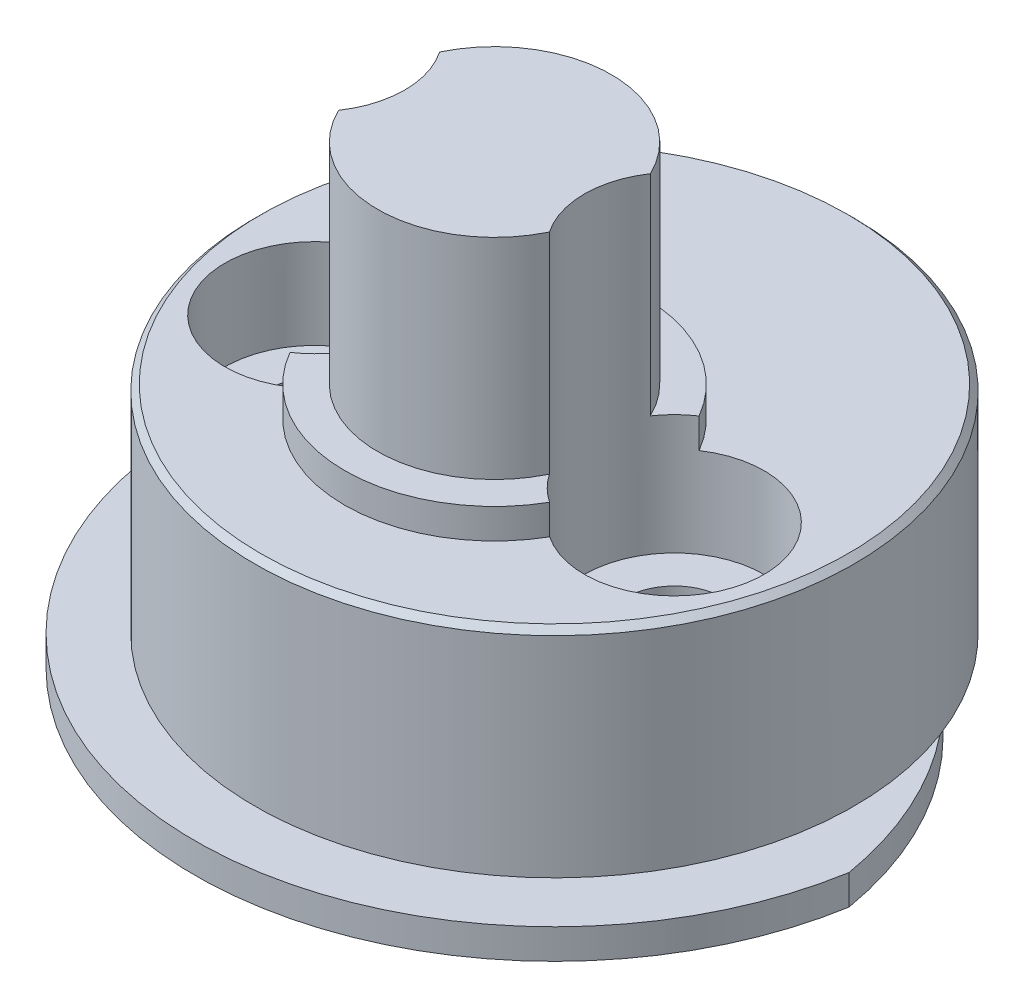
ISO-10303-21;
HEADER;
FILE_DESCRIPTION(('STEP AP214'),'2;1');
FILE_NAME('part.step','',(''),(''),'','','');
FILE_SCHEMA(('AUTOMOTIVE_DESIGN { 1 0 10303 214 1 1 1 1 }'));
ENDSEC;
DATA;
#1=APPLICATION_CONTEXT('core data for automotive mechanical design processes');
#2=APPLICATION_PROTOCOL_DEFINITION('international standard','automotive_design',2000,#1);
#3=PRODUCT_CONTEXT('',#1,'mechanical');
#4=PRODUCT('Part','Part','',(#3));
#5=PRODUCT_RELATED_PRODUCT_CATEGORY('part','',(#4));
#6=PRODUCT_DEFINITION_FORMATION('','',#4);
#7=PRODUCT_DEFINITION_CONTEXT('part definition',#1,'design');
#8=PRODUCT_DEFINITION('design','',#6,#7);
#9=PRODUCT_DEFINITION_SHAPE('','',#8);
#10=(LENGTH_UNIT() NAMED_UNIT(*) SI_UNIT(.MILLI.,.METRE.));
#11=(NAMED_UNIT(*) PLANE_ANGLE_UNIT() SI_UNIT($,.RADIAN.));
#12=(NAMED_UNIT(*) SI_UNIT($,.STERADIAN.) SOLID_ANGLE_UNIT());
#13=UNCERTAINTY_MEASURE_WITH_UNIT(LENGTH_MEASURE(1.E-05),#10,'distance_accuracy_value','');
#14=(GEOMETRIC_REPRESENTATION_CONTEXT(3) GLOBAL_UNCERTAINTY_ASSIGNED_CONTEXT((#13)) GLOBAL_UNIT_ASSIGNED_CONTEXT((#10,
#11,#12)) REPRESENTATION_CONTEXT('',''));
#15=CARTESIAN_POINT('',(0.,0.,0.));
#16=DIRECTION('',(0.,0.,1.));
#17=DIRECTION('',(1.,0.,0.));
#18=AXIS2_PLACEMENT_3D('',#15,#16,#17);
#19=CARTESIAN_POINT('',(-6.,1.,0.));
#20=DIRECTION('',(0.,-1.,0.));
#21=DIRECTION('',(0.,0.,-1.));
#22=AXIS2_PLACEMENT_3D('',#19,#20,#21);
#23=CYLINDRICAL_SURFACE('',#22,1.65);
#24=CARTESIAN_POINT('',(-6.,0.,0.));
#25=DIRECTION('',(0.,1.,0.));
#26=DIRECTION('',(0.,0.,1.));
#27=AXIS2_PLACEMENT_3D('',#24,#25,#26);
#28=CIRCLE('',#27,1.65);
#29=CARTESIAN_POINT('',(-6.,0.,1.65));
#30=VERTEX_POINT('',#29);
#31=EDGE_CURVE('E209',#30,#30,#28,.T.);
#32=ORIENTED_EDGE('',*,*,#31,.F.);
#33=EDGE_LOOP('',(#32));
#34=FACE_BOUND('',#33,.T.);
#35=CARTESIAN_POINT('',(-6.,5.2,0.));
#36=DIRECTION('',(0.,1.,0.));
#37=DIRECTION('',(0.,0.,1.));
#38=AXIS2_PLACEMENT_3D('',#35,#36,#37);
#39=CIRCLE('',#38,1.65);
#40=CARTESIAN_POINT('',(-6.,5.2,1.65));
#41=VERTEX_POINT('',#40);
#42=EDGE_CURVE('E172',#41,#41,#39,.T.);
#43=ORIENTED_EDGE('',*,*,#42,.T.);
#44=EDGE_LOOP('',(#43));
#45=FACE_BOUND('',#44,.T.);
#46=ADVANCED_FACE('F43',(#34,#45),#23,.F.);
#47=CARTESIAN_POINT('',(6.,1.,0.));
#48=DIRECTION('',(0.,-1.,0.));
#49=DIRECTION('',(0.,0.,-1.));
#50=AXIS2_PLACEMENT_3D('',#47,#48,#49);
#51=CYLINDRICAL_SURFACE('',#50,1.65);
#52=CARTESIAN_POINT('',(6.,0.,0.));
#53=DIRECTION('',(0.,1.,0.));
#54=DIRECTION('',(0.,0.,1.));
#55=AXIS2_PLACEMENT_3D('',#52,#53,#54);
#56=CIRCLE('',#55,1.65);
#57=CARTESIAN_POINT('',(6.,0.,1.65));
#58=VERTEX_POINT('',#57);
#59=EDGE_CURVE('E206',#58,#58,#56,.T.);
#60=ORIENTED_EDGE('',*,*,#59,.F.);
#61=EDGE_LOOP('',(#60));
#62=FACE_BOUND('',#61,.T.);
#63=CARTESIAN_POINT('',(6.,5.2,0.));
#64=DIRECTION('',(0.,1.,0.));
#65=DIRECTION('',(0.,0.,1.));
#66=AXIS2_PLACEMENT_3D('',#63,#64,#65);
#67=CIRCLE('',#66,1.65);
#68=CARTESIAN_POINT('',(6.,5.2,1.65));
#69=VERTEX_POINT('',#68);
#70=EDGE_CURVE('E176',#69,#69,#67,.T.);
#71=ORIENTED_EDGE('',*,*,#70,.T.);
#72=EDGE_LOOP('',(#71));
#73=FACE_BOUND('',#72,.T.);
#74=ADVANCED_FACE('F271',(#62,#73),#51,.F.);
#75=CARTESIAN_POINT('',(0.,9.2,0.));
#76=DIRECTION('',(0.,-1.,0.));
#77=DIRECTION('',(0.,0.,-1.));
#78=AXIS2_PLACEMENT_3D('',#75,#76,#77);
#79=CYLINDRICAL_SURFACE('',#78,5.);
#80=DIRECTION('',(0.,-1.,0.));
#81=VECTOR('',#80,1.);
#82=CARTESIAN_POINT('',(-4.33333333333333,12.2,-2.49443825784929));
#83=LINE('',#82,#81);
#84=CARTESIAN_POINT('',(-4.33333333333333,9.2,-2.49443825784929));
#85=VERTEX_POINT('',#84);
#86=CARTESIAN_POINT('',(-4.33333333333333,8.2,-2.49443825784929));
#87=VERTEX_POINT('',#86);
#88=EDGE_CURVE('E397',#85,#87,#83,.T.);
#89=ORIENTED_EDGE('',*,*,#88,.F.);
#90=CARTESIAN_POINT('',(0.,9.2,0.));
#91=DIRECTION('',(0.,1.,0.));
#92=DIRECTION('',(0.,0.,1.));
#93=AXIS2_PLACEMENT_3D('',#90,#91,#92);
#94=CIRCLE('',#93,5.);
#95=CARTESIAN_POINT('',(4.33333333333333,9.2,-2.49443825784929));
#96=VERTEX_POINT('',#95);
#97=EDGE_CURVE('E186',#96,#85,#94,.T.);
#98=ORIENTED_EDGE('',*,*,#97,.F.);
#99=DIRECTION('',(0.,-1.,0.));
#100=VECTOR('',#99,1.);
#101=CARTESIAN_POINT('',(4.33333333333333,12.2,-2.49443825784929));
#102=LINE('',#101,#100);
#103=CARTESIAN_POINT('',(4.33333333333333,8.2,-2.49443825784929));
#104=VERTEX_POINT('',#103);
#105=EDGE_CURVE('E384',#104,#96,#102,.F.);
#106=ORIENTED_EDGE('',*,*,#105,.F.);
#107=CARTESIAN_POINT('',(0.,8.2,0.));
#108=DIRECTION('',(0.,1.,0.));
#109=DIRECTION('',(0.,0.,1.));
#110=AXIS2_PLACEMENT_3D('',#107,#108,#109);
#111=CIRCLE('',#110,5.);
#112=EDGE_CURVE('E183',#104,#87,#111,.T.);
#113=ORIENTED_EDGE('',*,*,#112,.T.);
#114=EDGE_LOOP('',(#89,#98,#106,#113));
#115=FACE_BOUND('',#114,.T.);
#116=ADVANCED_FACE('F278',(#115),#79,.T.);
#117=DIRECTION('',(0.,-1.,0.));
#118=VECTOR('',#117,1.);
#119=CARTESIAN_POINT('',(-4.33333333333333,12.2,2.49443825784929));
#120=LINE('',#119,#118);
#121=CARTESIAN_POINT('',(-4.33333333333333,8.2,2.4944382578493));
#122=VERTEX_POINT('',#121);
#123=CARTESIAN_POINT('',(-4.33333333333333,9.2,2.49443825784929));
#124=VERTEX_POINT('',#123);
#125=EDGE_CURVE('E369',#122,#124,#120,.F.);
#126=ORIENTED_EDGE('',*,*,#125,.F.);
#127=CARTESIAN_POINT('',(4.33333333333333,8.2,2.49443825784929));
#128=VERTEX_POINT('',#127);
#129=EDGE_CURVE('E187',#122,#128,#111,.T.);
#130=ORIENTED_EDGE('',*,*,#129,.T.);
#131=DIRECTION('',(0.,-1.,0.));
#132=VECTOR('',#131,1.);
#133=CARTESIAN_POINT('',(4.33333333333333,12.2,2.49443825784929));
#134=LINE('',#133,#132);
#135=CARTESIAN_POINT('',(4.33333333333333,9.2,2.49443825784929));
#136=VERTEX_POINT('',#135);
#137=EDGE_CURVE('E386',#136,#128,#134,.T.);
#138=ORIENTED_EDGE('',*,*,#137,.F.);
#139=EDGE_CURVE('E174',#124,#136,#94,.T.);
#140=ORIENTED_EDGE('',*,*,#139,.F.);
#141=EDGE_LOOP('',(#126,#130,#138,#140));
#142=FACE_BOUND('',#141,.T.);
#143=ADVANCED_FACE('F346',(#142),#79,.T.);
#144=CARTESIAN_POINT('',(0.,9.2,0.));
#145=DIRECTION('',(0.,1.,0.));
#146=DIRECTION('',(0.,0.,1.));
#147=AXIS2_PLACEMENT_3D('',#144,#145,#146);
#148=PLANE('',#147);
#149=ORIENTED_EDGE('',*,*,#97,.T.);
#150=CARTESIAN_POINT('',(-6.,9.2,0.));
#151=DIRECTION('',(0.,1.,0.));
#152=DIRECTION('',(0.,0.,1.));
#153=AXIS2_PLACEMENT_3D('',#150,#151,#152);
#154=CIRCLE('',#153,3.);
#155=CARTESIAN_POINT('',(-3.5175,9.2,-1.68439714734975));
#156=VERTEX_POINT('',#155);
#157=EDGE_CURVE('E396',#85,#156,#154,.F.);
#158=ORIENTED_EDGE('',*,*,#157,.T.);
#159=CARTESIAN_POINT('',(0.,9.2,0.));
#160=DIRECTION('',(0.,1.,0.));
#161=DIRECTION('',(0.,0.,1.));
#162=AXIS2_PLACEMENT_3D('',#159,#160,#161);
#163=CIRCLE('',#162,3.9);
#164=CARTESIAN_POINT('',(3.5175,9.2,-1.68439714734976));
#165=VERTEX_POINT('',#164);
#166=EDGE_CURVE('E159',#165,#156,#163,.T.);
#167=ORIENTED_EDGE('',*,*,#166,.F.);
#168=CARTESIAN_POINT('',(6.,9.2,0.));
#169=DIRECTION('',(0.,1.,0.));
#170=DIRECTION('',(0.,0.,1.));
#171=AXIS2_PLACEMENT_3D('',#168,#169,#170);
#172=CIRCLE('',#171,3.);
#173=EDGE_CURVE('E168',#165,#96,#172,.F.);
#174=ORIENTED_EDGE('',*,*,#173,.T.);
#175=EDGE_LOOP('',(#149,#158,#167,#174));
#176=FACE_BOUND('',#175,.T.);
#177=ADVANCED_FACE('F351',(#176),#148,.T.);
#178=CARTESIAN_POINT('',(0.,16.2,0.));
#179=DIRECTION('',(0.,-1.,0.));
#180=DIRECTION('',(0.,0.,-1.));
#181=AXIS2_PLACEMENT_3D('',#178,#179,#180);
#182=CYLINDRICAL_SURFACE('',#181,3.9);
#183=DIRECTION('',(0.,-1.,0.));
#184=VECTOR('',#183,1.);
#185=CARTESIAN_POINT('',(-3.5175,12.2,-1.68439714734976));
#186=LINE('',#185,#184);
#187=CARTESIAN_POINT('',(-3.5175,16.2,-1.68439714734976));
#188=VERTEX_POINT('',#187);
#189=EDGE_CURVE('E392',#188,#156,#186,.T.);
#190=ORIENTED_EDGE('',*,*,#189,.F.);
#191=CARTESIAN_POINT('',(0.,16.2,0.));
#192=DIRECTION('',(0.,1.,0.));
#193=DIRECTION('',(0.,0.,1.));
#194=AXIS2_PLACEMENT_3D('',#191,#192,#193);
#195=CIRCLE('',#194,3.9);
#196=CARTESIAN_POINT('',(3.5175,16.2,-1.68439714734976));
#197=VERTEX_POINT('',#196);
#198=EDGE_CURVE('E171',#197,#188,#195,.T.);
#199=ORIENTED_EDGE('',*,*,#198,.F.);
#200=DIRECTION('',(0.,-1.,0.));
#201=VECTOR('',#200,1.);
#202=CARTESIAN_POINT('',(3.5175,12.2,-1.68439714734976));
#203=LINE('',#202,#201);
#204=EDGE_CURVE('E67',#165,#197,#203,.F.);
#205=ORIENTED_EDGE('',*,*,#204,.F.);
#206=ORIENTED_EDGE('',*,*,#166,.T.);
#207=EDGE_LOOP('',(#190,#199,#205,#206));
#208=FACE_BOUND('',#207,.T.);
#209=ADVANCED_FACE('F352',(#208),#182,.T.);
#210=DIRECTION('',(0.,-1.,0.));
#211=VECTOR('',#210,1.);
#212=CARTESIAN_POINT('',(-3.5175,12.2,1.68439714734976));
#213=LINE('',#212,#211);
#214=CARTESIAN_POINT('',(-3.5175,9.2,1.68439714734976));
#215=VERTEX_POINT('',#214);
#216=CARTESIAN_POINT('',(-3.5175,16.2,1.68439714734976));
#217=VERTEX_POINT('',#216);
#218=EDGE_CURVE('E59',#215,#217,#213,.F.);
#219=ORIENTED_EDGE('',*,*,#218,.F.);
#220=CARTESIAN_POINT('',(3.5175,9.2,1.68439714734976));
#221=VERTEX_POINT('',#220);
#222=EDGE_CURVE('E167',#215,#221,#163,.T.);
#223=ORIENTED_EDGE('',*,*,#222,.T.);
#224=DIRECTION('',(0.,-1.,0.));
#225=VECTOR('',#224,1.);
#226=CARTESIAN_POINT('',(3.5175,12.2,1.68439714734976));
#227=LINE('',#226,#225);
#228=CARTESIAN_POINT('',(3.5175,16.2,1.68439714734976));
#229=VERTEX_POINT('',#228);
#230=EDGE_CURVE('E152',#229,#221,#227,.T.);
#231=ORIENTED_EDGE('',*,*,#230,.F.);
#232=EDGE_CURVE('E165',#217,#229,#195,.T.);
#233=ORIENTED_EDGE('',*,*,#232,.F.);
#234=EDGE_LOOP('',(#219,#223,#231,#233));
#235=FACE_BOUND('',#234,.T.);
#236=ADVANCED_FACE('F164',(#235),#182,.T.);
#237=CARTESIAN_POINT('',(0.,1.,0.));
#238=DIRECTION('',(0.,1.,0.));
#239=DIRECTION('',(0.,0.,1.));
#240=AXIS2_PLACEMENT_3D('',#237,#238,#239);
#241=PLANE('',#240);
#242=CARTESIAN_POINT('',(0.,1.,-2.));
#243=DIRECTION('',(0.,1.,0.));
#244=DIRECTION('',(0.,0.,1.));
#245=AXIS2_PLACEMENT_3D('',#242,#243,#244);
#246=CIRCLE('',#245,10.);
#247=CARTESIAN_POINT('',(-9.3674969975976,1.,-5.5));
#248=VERTEX_POINT('',#247);
#249=CARTESIAN_POINT('',(9.3674969975976,1.,-5.49999999999999));
#250=VERTEX_POINT('',#249);
#251=EDGE_CURVE('E190',#248,#250,#246,.T.);
#252=ORIENTED_EDGE('',*,*,#251,.F.);
#253=CARTESIAN_POINT('',(0.,1.,2.));
#254=DIRECTION('',(0.,1.,0.));
#255=DIRECTION('',(0.,0.,1.));
#256=AXIS2_PLACEMENT_3D('',#253,#254,#255);
#257=CIRCLE('',#256,12.);
#258=CARTESIAN_POINT('',(-11.8321595661992,1.,0.));
#259=VERTEX_POINT('',#258);
#260=EDGE_CURVE('E239',#248,#259,#257,.T.);
#261=ORIENTED_EDGE('',*,*,#260,.T.);
#262=CARTESIAN_POINT('',(0.,1.,-2.));
#263=DIRECTION('',(0.,1.,0.));
#264=DIRECTION('',(0.,0.,1.));
#265=AXIS2_PLACEMENT_3D('',#262,#263,#264);
#266=CIRCLE('',#265,12.);
#267=CARTESIAN_POINT('',(11.8321595661992,1.,0.));
#268=VERTEX_POINT('',#267);
#269=EDGE_CURVE('E237',#259,#268,#266,.T.);
#270=ORIENTED_EDGE('',*,*,#269,.T.);
#271=EDGE_CURVE('E235',#268,#250,#257,.T.);
#272=ORIENTED_EDGE('',*,*,#271,.T.);
#273=EDGE_LOOP('',(#252,#261,#270,#272));
#274=FACE_BOUND('',#273,.T.);
#275=ADVANCED_FACE('F303',(#274),#241,.T.);
#276=CARTESIAN_POINT('',(0.,0.,0.));
#277=DIRECTION('',(0.,1.,0.));
#278=DIRECTION('',(0.,0.,1.));
#279=AXIS2_PLACEMENT_3D('',#276,#277,#278);
#280=PLANE('',#279);
#281=CARTESIAN_POINT('',(0.,0.,2.));
#282=DIRECTION('',(0.,1.,0.));
#283=DIRECTION('',(0.,0.,1.));
#284=AXIS2_PLACEMENT_3D('',#281,#282,#283);
#285=CIRCLE('',#284,12.);
#286=CARTESIAN_POINT('',(11.8321595661992,0.,0.));
#287=VERTEX_POINT('',#286);
#288=CARTESIAN_POINT('',(-11.8321595661992,0.,0.));
#289=VERTEX_POINT('',#288);
#290=EDGE_CURVE('E234',#287,#289,#285,.T.);
#291=ORIENTED_EDGE('',*,*,#290,.F.);
#292=CARTESIAN_POINT('',(0.,0.,-2.));
#293=DIRECTION('',(0.,1.,0.));
#294=DIRECTION('',(0.,0.,1.));
#295=AXIS2_PLACEMENT_3D('',#292,#293,#294);
#296=CIRCLE('',#295,12.);
#297=EDGE_CURVE('E244',#289,#287,#296,.T.);
#298=ORIENTED_EDGE('',*,*,#297,.F.);
#299=EDGE_LOOP('',(#291,#298));
#300=FACE_BOUND('',#299,.T.);
#301=DIRECTION('',(0.,0.,-1.));
#302=VECTOR('',#301,1.);
#303=CARTESIAN_POINT('',(2.75,0.,5.25));
#304=LINE('',#303,#302);
#305=CARTESIAN_POINT('',(2.75,0.,5.25));
#306=VERTEX_POINT('',#305);
#307=CARTESIAN_POINT('',(2.75,0.,-5.25));
#308=VERTEX_POINT('',#307);
#309=EDGE_CURVE('E212',#306,#308,#304,.T.);
#310=ORIENTED_EDGE('',*,*,#309,.T.);
#311=DIRECTION('',(-1.,0.,0.));
#312=VECTOR('',#311,1.);
#313=CARTESIAN_POINT('',(-2.75,0.,-5.25));
#314=LINE('',#313,#312);
#315=CARTESIAN_POINT('',(-2.75,0.,-5.25));
#316=VERTEX_POINT('',#315);
#317=EDGE_CURVE('E215',#308,#316,#314,.T.);
#318=ORIENTED_EDGE('',*,*,#317,.T.);
#319=DIRECTION('',(0.,0.,1.));
#320=VECTOR('',#319,1.);
#321=CARTESIAN_POINT('',(-2.75,0.,5.25));
#322=LINE('',#321,#320);
#323=CARTESIAN_POINT('',(-2.75,0.,5.25));
#324=VERTEX_POINT('',#323);
#325=EDGE_CURVE('E218',#316,#324,#322,.T.);
#326=ORIENTED_EDGE('',*,*,#325,.T.);
#327=DIRECTION('',(1.,0.,0.));
#328=VECTOR('',#327,1.);
#329=CARTESIAN_POINT('',(-2.75,0.,5.25));
#330=LINE('',#329,#328);
#331=EDGE_CURVE('E221',#324,#306,#330,.T.);
#332=ORIENTED_EDGE('',*,*,#331,.T.);
#333=EDGE_LOOP('',(#310,#318,#326,#332));
#334=FACE_BOUND('',#333,.T.);
#335=ORIENTED_EDGE('',*,*,#31,.T.);
#336=EDGE_LOOP('',(#335));
#337=FACE_BOUND('',#336,.T.);
#338=ORIENTED_EDGE('',*,*,#59,.T.);
#339=EDGE_LOOP('',(#338));
#340=FACE_BOUND('',#339,.T.);
#341=ADVANCED_FACE('F306',(#300,#334,#337,#340),#280,.F.);
#342=CARTESIAN_POINT('',(0.,1.,2.));
#343=DIRECTION('',(0.,-1.,0.));
#344=DIRECTION('',(0.,0.,-1.));
#345=AXIS2_PLACEMENT_3D('',#342,#343,#344);
#346=CYLINDRICAL_SURFACE('',#345,12.);
#347=ORIENTED_EDGE('',*,*,#290,.T.);
#348=DIRECTION('',(0.,-1.,0.));
#349=VECTOR('',#348,1.);
#350=CARTESIAN_POINT('',(-11.8321595661992,1.,0.));
#351=LINE('',#350,#349);
#352=EDGE_CURVE('E248',#259,#289,#351,.T.);
#353=ORIENTED_EDGE('',*,*,#352,.F.);
#354=ORIENTED_EDGE('',*,*,#260,.F.);
#355=EDGE_CURVE('E238',#250,#248,#257,.T.);
#356=ORIENTED_EDGE('',*,*,#355,.F.);
#357=ORIENTED_EDGE('',*,*,#271,.F.);
#358=DIRECTION('',(0.,-1.,0.));
#359=VECTOR('',#358,1.);
#360=CARTESIAN_POINT('',(11.8321595661992,1.,0.));
#361=LINE('',#360,#359);
#362=EDGE_CURVE('E241',#268,#287,#361,.T.);
#363=ORIENTED_EDGE('',*,*,#362,.T.);
#364=EDGE_LOOP('',(#347,#353,#354,#356,#357,#363));
#365=FACE_BOUND('',#364,.T.);
#366=ADVANCED_FACE('F310',(#365),#346,.T.);
#367=CARTESIAN_POINT('',(0.,1.,-2.));
#368=DIRECTION('',(0.,-1.,0.));
#369=DIRECTION('',(0.,0.,-1.));
#370=AXIS2_PLACEMENT_3D('',#367,#368,#369);
#371=CYLINDRICAL_SURFACE('',#370,12.);
#372=ORIENTED_EDGE('',*,*,#297,.T.);
#373=ORIENTED_EDGE('',*,*,#362,.F.);
#374=ORIENTED_EDGE('',*,*,#269,.F.);
#375=ORIENTED_EDGE('',*,*,#352,.T.);
#376=EDGE_LOOP('',(#372,#373,#374,#375));
#377=FACE_BOUND('',#376,.T.);
#378=ADVANCED_FACE('F301',(#377),#371,.T.);
#379=CARTESIAN_POINT('',(2.75,1.,5.25));
#380=DIRECTION('',(-1.,0.,0.));
#381=DIRECTION('',(0.,0.,1.));
#382=AXIS2_PLACEMENT_3D('',#379,#380,#381);
#383=PLANE('',#382);
#384=ORIENTED_EDGE('',*,*,#309,.F.);
#385=DIRECTION('',(0.,-1.,0.));
#386=VECTOR('',#385,1.);
#387=CARTESIAN_POINT('',(2.75,1.,5.25));
#388=LINE('',#387,#386);
#389=CARTESIAN_POINT('',(2.75,5.2,5.25));
#390=VERTEX_POINT('',#389);
#391=EDGE_CURVE('E224',#390,#306,#388,.T.);
#392=ORIENTED_EDGE('',*,*,#391,.F.);
#393=DIRECTION('',(0.,0.,-1.));
#394=VECTOR('',#393,1.);
#395=CARTESIAN_POINT('',(2.75,5.2,5.25));
#396=LINE('',#395,#394);
#397=CARTESIAN_POINT('',(2.75,5.2,-5.25));
#398=VERTEX_POINT('',#397);
#399=EDGE_CURVE('E197',#390,#398,#396,.T.);
#400=ORIENTED_EDGE('',*,*,#399,.T.);
#401=DIRECTION('',(0.,-1.,0.));
#402=VECTOR('',#401,1.);
#403=CARTESIAN_POINT('',(2.75,1.,-5.25));
#404=LINE('',#403,#402);
#405=EDGE_CURVE('E231',#398,#308,#404,.T.);
#406=ORIENTED_EDGE('',*,*,#405,.T.);
#407=EDGE_LOOP('',(#384,#392,#400,#406));
#408=FACE_BOUND('',#407,.T.);
#409=ADVANCED_FACE('F297',(#408),#383,.T.);
#410=CARTESIAN_POINT('',(-2.75,1.,-5.25));
#411=DIRECTION('',(0.,0.,1.));
#412=DIRECTION('',(1.,0.,0.));
#413=AXIS2_PLACEMENT_3D('',#410,#411,#412);
#414=PLANE('',#413);
#415=ORIENTED_EDGE('',*,*,#317,.F.);
#416=ORIENTED_EDGE('',*,*,#405,.F.);
#417=DIRECTION('',(-1.,0.,0.));
#418=VECTOR('',#417,1.);
#419=CARTESIAN_POINT('',(2.75,5.2,-5.25));
#420=LINE('',#419,#418);
#421=CARTESIAN_POINT('',(-2.75,5.2,-5.25));
#422=VERTEX_POINT('',#421);
#423=EDGE_CURVE('E200',#398,#422,#420,.T.);
#424=ORIENTED_EDGE('',*,*,#423,.T.);
#425=DIRECTION('',(0.,-1.,0.));
#426=VECTOR('',#425,1.);
#427=CARTESIAN_POINT('',(-2.75,1.,-5.25));
#428=LINE('',#427,#426);
#429=EDGE_CURVE('E229',#422,#316,#428,.T.);
#430=ORIENTED_EDGE('',*,*,#429,.T.);
#431=EDGE_LOOP('',(#415,#416,#424,#430));
#432=FACE_BOUND('',#431,.T.);
#433=ADVANCED_FACE('F293',(#432),#414,.T.);
#434=CARTESIAN_POINT('',(-2.75,1.,5.25));
#435=DIRECTION('',(1.,0.,0.));
#436=DIRECTION('',(0.,0.,-1.));
#437=AXIS2_PLACEMENT_3D('',#434,#435,#436);
#438=PLANE('',#437);
#439=ORIENTED_EDGE('',*,*,#325,.F.);
#440=ORIENTED_EDGE('',*,*,#429,.F.);
#441=DIRECTION('',(0.,0.,1.));
#442=VECTOR('',#441,1.);
#443=CARTESIAN_POINT('',(-2.75,5.2,-5.25));
#444=LINE('',#443,#442);
#445=CARTESIAN_POINT('',(-2.75,5.2,5.25));
#446=VERTEX_POINT('',#445);
#447=EDGE_CURVE('E191',#422,#446,#444,.T.);
#448=ORIENTED_EDGE('',*,*,#447,.T.);
#449=DIRECTION('',(0.,-1.,0.));
#450=VECTOR('',#449,1.);
#451=CARTESIAN_POINT('',(-2.75,1.,5.25));
#452=LINE('',#451,#450);
#453=EDGE_CURVE('E227',#446,#324,#452,.T.);
#454=ORIENTED_EDGE('',*,*,#453,.T.);
#455=EDGE_LOOP('',(#439,#440,#448,#454));
#456=FACE_BOUND('',#455,.T.);
#457=ADVANCED_FACE('F289',(#456),#438,.T.);
#458=CARTESIAN_POINT('',(-2.75,1.,5.25));
#459=DIRECTION('',(0.,0.,-1.));
#460=DIRECTION('',(-1.,0.,0.));
#461=AXIS2_PLACEMENT_3D('',#458,#459,#460);
#462=PLANE('',#461);
#463=ORIENTED_EDGE('',*,*,#331,.F.);
#464=ORIENTED_EDGE('',*,*,#453,.F.);
#465=DIRECTION('',(1.,0.,0.));
#466=VECTOR('',#465,1.);
#467=CARTESIAN_POINT('',(-2.75,5.2,5.25));
#468=LINE('',#467,#466);
#469=EDGE_CURVE('E194',#446,#390,#468,.T.);
#470=ORIENTED_EDGE('',*,*,#469,.T.);
#471=ORIENTED_EDGE('',*,*,#391,.T.);
#472=EDGE_LOOP('',(#463,#464,#470,#471));
#473=FACE_BOUND('',#472,.T.);
#474=ADVANCED_FACE('F285',(#473),#462,.T.);
#475=CARTESIAN_POINT('',(0.,1.,-2.));
#476=DIRECTION('',(0.,1.,0.));
#477=DIRECTION('',(0.,0.,1.));
#478=AXIS2_PLACEMENT_3D('',#475,#476,#477);
#479=PLANE('',#478);
#480=EDGE_CURVE('E203',#250,#248,#246,.T.);
#481=ORIENTED_EDGE('',*,*,#480,.F.);
#482=ORIENTED_EDGE('',*,*,#355,.T.);
#483=EDGE_LOOP('',(#481,#482));
#484=FACE_BOUND('',#483,.T.);
#485=ADVANCED_FACE('F288',(#484),#479,.F.);
#486=CARTESIAN_POINT('',(0.,5.2,-2.));
#487=DIRECTION('',(0.,-1.,0.));
#488=DIRECTION('',(0.,0.,-1.));
#489=AXIS2_PLACEMENT_3D('',#486,#487,#488);
#490=CYLINDRICAL_SURFACE('',#489,10.);
#491=CARTESIAN_POINT('',(0.,8.00000000000001,-2.));
#492=DIRECTION('',(0.,1.,0.));
#493=DIRECTION('',(0.,0.,1.));
#494=AXIS2_PLACEMENT_3D('',#491,#492,#493);
#495=CIRCLE('',#494,10.);
#496=CARTESIAN_POINT('',(0.,8.00000000000001,-12.));
#497=VERTEX_POINT('',#496);
#498=EDGE_CURVE('E11',#497,#497,#495,.F.);
#499=ORIENTED_EDGE('',*,*,#498,.T.);
#500=EDGE_LOOP('',(#499));
#501=FACE_BOUND('',#500,.T.);
#502=ORIENTED_EDGE('',*,*,#480,.T.);
#503=ORIENTED_EDGE('',*,*,#251,.T.);
#504=EDGE_LOOP('',(#502,#503));
#505=FACE_BOUND('',#504,.T.);
#506=ADVANCED_FACE('F332',(#501,#505),#490,.T.);
#507=CARTESIAN_POINT('',(0.,5.2,-2.));
#508=DIRECTION('',(0.,1.,0.));
#509=DIRECTION('',(0.,0.,1.));
#510=AXIS2_PLACEMENT_3D('',#507,#508,#509);
#511=PLANE('',#510);
#512=ORIENTED_EDGE('',*,*,#469,.F.);
#513=ORIENTED_EDGE('',*,*,#447,.F.);
#514=ORIENTED_EDGE('',*,*,#423,.F.);
#515=ORIENTED_EDGE('',*,*,#399,.F.);
#516=EDGE_LOOP('',(#512,#513,#514,#515));
#517=FACE_BOUND('',#516,.T.);
#518=ADVANCED_FACE('F334',(#517),#511,.F.);
#519=CARTESIAN_POINT('',(0.,8.2,-2.));
#520=DIRECTION('',(0.,1.,0.));
#521=DIRECTION('',(0.,0.,1.));
#522=AXIS2_PLACEMENT_3D('',#519,#520,#521);
#523=PLANE('',#522);
#524=CARTESIAN_POINT('',(0.,8.2,-2.));
#525=DIRECTION('',(0.,1.,0.));
#526=DIRECTION('',(0.,0.,1.));
#527=AXIS2_PLACEMENT_3D('',#524,#525,#526);
#528=CIRCLE('',#527,9.80000000000001);
#529=CARTESIAN_POINT('',(0.,8.2,-11.8));
#530=VERTEX_POINT('',#529);
#531=EDGE_CURVE('E52',#530,#530,#528,.T.);
#532=ORIENTED_EDGE('',*,*,#531,.T.);
#533=EDGE_LOOP('',(#532));
#534=FACE_BOUND('',#533,.T.);
#535=ORIENTED_EDGE('',*,*,#129,.F.);
#536=CARTESIAN_POINT('',(-6.,8.2,0.));
#537=DIRECTION('',(0.,1.,0.));
#538=DIRECTION('',(0.,0.,1.));
#539=AXIS2_PLACEMENT_3D('',#536,#537,#538);
#540=CIRCLE('',#539,3.);
#541=EDGE_CURVE('E180',#122,#87,#540,.F.);
#542=ORIENTED_EDGE('',*,*,#541,.T.);
#543=ORIENTED_EDGE('',*,*,#112,.F.);
#544=CARTESIAN_POINT('',(6.,8.2,0.));
#545=DIRECTION('',(0.,1.,0.));
#546=DIRECTION('',(0.,0.,1.));
#547=AXIS2_PLACEMENT_3D('',#544,#545,#546);
#548=CIRCLE('',#547,3.);
#549=EDGE_CURVE('E388',#104,#128,#548,.F.);
#550=ORIENTED_EDGE('',*,*,#549,.T.);
#551=EDGE_LOOP('',(#535,#542,#543,#550));
#552=FACE_BOUND('',#551,.T.);
#553=ADVANCED_FACE('F256',(#534,#552),#523,.T.);
#554=ORIENTED_EDGE('',*,*,#222,.F.);
#555=EDGE_CURVE('E394',#215,#124,#154,.F.);
#556=ORIENTED_EDGE('',*,*,#555,.T.);
#557=ORIENTED_EDGE('',*,*,#139,.T.);
#558=EDGE_CURVE('E383',#136,#221,#172,.F.);
#559=ORIENTED_EDGE('',*,*,#558,.T.);
#560=EDGE_LOOP('',(#554,#556,#557,#559));
#561=FACE_BOUND('',#560,.T.);
#562=ADVANCED_FACE('F343',(#561),#148,.T.);
#563=CARTESIAN_POINT('',(0.,16.2,0.));
#564=DIRECTION('',(0.,1.,0.));
#565=DIRECTION('',(0.,0.,1.));
#566=AXIS2_PLACEMENT_3D('',#563,#564,#565);
#567=PLANE('',#566);
#568=ORIENTED_EDGE('',*,*,#198,.T.);
#569=CARTESIAN_POINT('',(-6.,16.2,0.));
#570=DIRECTION('',(0.,1.,0.));
#571=DIRECTION('',(0.,0.,1.));
#572=AXIS2_PLACEMENT_3D('',#569,#570,#571);
#573=CIRCLE('',#572,3.);
#574=EDGE_CURVE('E158',#188,#217,#573,.F.);
#575=ORIENTED_EDGE('',*,*,#574,.T.);
#576=ORIENTED_EDGE('',*,*,#232,.T.);
#577=CARTESIAN_POINT('',(6.,16.2,0.));
#578=DIRECTION('',(0.,1.,0.));
#579=DIRECTION('',(0.,0.,1.));
#580=AXIS2_PLACEMENT_3D('',#577,#578,#579);
#581=CIRCLE('',#580,3.);
#582=EDGE_CURVE('E148',#229,#197,#581,.F.);
#583=ORIENTED_EDGE('',*,*,#582,.T.);
#584=EDGE_LOOP('',(#568,#575,#576,#583));
#585=FACE_BOUND('',#584,.T.);
#586=ADVANCED_FACE('F170',(#585),#567,.T.);
#587=CARTESIAN_POINT('',(6.,19.2,0.));
#588=DIRECTION('',(0.,-1.,0.));
#589=DIRECTION('',(0.,0.,-1.));
#590=AXIS2_PLACEMENT_3D('',#587,#588,#589);
#591=CYLINDRICAL_SURFACE('',#590,3.);
#592=ORIENTED_EDGE('',*,*,#105,.T.);
#593=ORIENTED_EDGE('',*,*,#173,.F.);
#594=ORIENTED_EDGE('',*,*,#204,.T.);
#595=ORIENTED_EDGE('',*,*,#582,.F.);
#596=ORIENTED_EDGE('',*,*,#230,.T.);
#597=ORIENTED_EDGE('',*,*,#558,.F.);
#598=ORIENTED_EDGE('',*,*,#137,.T.);
#599=ORIENTED_EDGE('',*,*,#549,.F.);
#600=EDGE_LOOP('',(#592,#593,#594,#595,#596,#597,#598,#599));
#601=FACE_BOUND('',#600,.T.);
#602=CARTESIAN_POINT('',(6.,5.2,0.));
#603=DIRECTION('',(0.,1.,0.));
#604=DIRECTION('',(0.,0.,1.));
#605=AXIS2_PLACEMENT_3D('',#602,#603,#604);
#606=CIRCLE('',#605,3.);
#607=CARTESIAN_POINT('',(6.,5.2,3.));
#608=VERTEX_POINT('',#607);
#609=EDGE_CURVE('E375',#608,#608,#606,.T.);
#610=ORIENTED_EDGE('',*,*,#609,.F.);
#611=EDGE_LOOP('',(#610));
#612=FACE_BOUND('',#611,.T.);
#613=ADVANCED_FACE('F150',(#601,#612),#591,.F.);
#614=CARTESIAN_POINT('',(6.,5.2,0.));
#615=DIRECTION('',(0.,1.,0.));
#616=DIRECTION('',(0.,0.,1.));
#617=AXIS2_PLACEMENT_3D('',#614,#615,#616);
#618=PLANE('',#617);
#619=ORIENTED_EDGE('',*,*,#70,.F.);
#620=EDGE_LOOP('',(#619));
#621=FACE_BOUND('',#620,.T.);
#622=ORIENTED_EDGE('',*,*,#609,.T.);
#623=EDGE_LOOP('',(#622));
#624=FACE_BOUND('',#623,.T.);
#625=ADVANCED_FACE('F358',(#621,#624),#618,.T.);
#626=CARTESIAN_POINT('',(-6.,19.2,0.));
#627=DIRECTION('',(0.,-1.,0.));
#628=DIRECTION('',(0.,0.,-1.));
#629=AXIS2_PLACEMENT_3D('',#626,#627,#628);
#630=CYLINDRICAL_SURFACE('',#629,3.);
#631=ORIENTED_EDGE('',*,*,#125,.T.);
#632=ORIENTED_EDGE('',*,*,#555,.F.);
#633=ORIENTED_EDGE('',*,*,#218,.T.);
#634=ORIENTED_EDGE('',*,*,#574,.F.);
#635=ORIENTED_EDGE('',*,*,#189,.T.);
#636=ORIENTED_EDGE('',*,*,#157,.F.);
#637=ORIENTED_EDGE('',*,*,#88,.T.);
#638=ORIENTED_EDGE('',*,*,#541,.F.);
#639=EDGE_LOOP('',(#631,#632,#633,#634,#635,#636,#637,#638));
#640=FACE_BOUND('',#639,.T.);
#641=CARTESIAN_POINT('',(-6.,5.2,0.));
#642=DIRECTION('',(0.,1.,0.));
#643=DIRECTION('',(0.,0.,1.));
#644=AXIS2_PLACEMENT_3D('',#641,#642,#643);
#645=CIRCLE('',#644,3.);
#646=CARTESIAN_POINT('',(-6.,5.2,3.));
#647=VERTEX_POINT('',#646);
#648=EDGE_CURVE('E373',#647,#647,#645,.T.);
#649=ORIENTED_EDGE('',*,*,#648,.F.);
#650=EDGE_LOOP('',(#649));
#651=FACE_BOUND('',#650,.T.);
#652=ADVANCED_FACE('F266',(#640,#651),#630,.F.);
#653=CARTESIAN_POINT('',(-6.,5.2,0.));
#654=DIRECTION('',(0.,1.,0.));
#655=DIRECTION('',(0.,0.,1.));
#656=AXIS2_PLACEMENT_3D('',#653,#654,#655);
#657=PLANE('',#656);
#658=ORIENTED_EDGE('',*,*,#42,.F.);
#659=EDGE_LOOP('',(#658));
#660=FACE_BOUND('',#659,.T.);
#661=ORIENTED_EDGE('',*,*,#648,.T.);
#662=EDGE_LOOP('',(#661));
#663=FACE_BOUND('',#662,.T.);
#664=ADVANCED_FACE('F260',(#660,#663),#657,.T.);
#665=CARTESIAN_POINT('',(0.,8.2,-2.));
#666=DIRECTION('',(0.,-1.,0.));
#667=DIRECTION('',(0.,0.,-1.));
#668=AXIS2_PLACEMENT_3D('',#665,#666,#667);
#669=CONICAL_SURFACE('',#668,9.80000000000001,0.785398163397448);
#670=CARTESIAN_POINT('',(0.,8.00000000000001,-12.));
#671=CARTESIAN_POINT('',(0.,8.00208333333334,-11.9979166666667));
#672=CARTESIAN_POINT('',(0.,8.00416666666667,-11.9958333333333));
#673=CARTESIAN_POINT('',(0.,8.00833333333334,-11.9916666666667));
#674=CARTESIAN_POINT('',(0.,8.01041666666667,-11.9895833333333));
#675=CARTESIAN_POINT('',(0.,8.01458333333334,-11.9854166666667));
#676=CARTESIAN_POINT('',(0.,8.01666666666667,-11.9833333333333));
#677=CARTESIAN_POINT('',(0.,8.02083333333334,-11.9791666666667));
#678=CARTESIAN_POINT('',(0.,8.02291666666667,-11.9770833333333));
#679=CARTESIAN_POINT('',(0.,8.02708333333334,-11.9729166666667));
#680=CARTESIAN_POINT('',(0.,8.02916666666667,-11.9708333333333));
#681=CARTESIAN_POINT('',(0.,8.03333333333334,-11.9666666666667));
#682=CARTESIAN_POINT('',(0.,8.03541666666667,-11.9645833333333));
#683=CARTESIAN_POINT('',(0.,8.03958333333334,-11.9604166666667));
#684=CARTESIAN_POINT('',(0.,8.04166666666667,-11.9583333333333));
#685=CARTESIAN_POINT('',(0.,8.04583333333334,-11.9541666666667));
#686=CARTESIAN_POINT('',(0.,8.04791666666667,-11.9520833333333));
#687=CARTESIAN_POINT('',(0.,8.05208333333334,-11.9479166666667));
#688=CARTESIAN_POINT('',(0.,8.05416666666667,-11.9458333333333));
#689=CARTESIAN_POINT('',(0.,8.05833333333334,-11.9416666666667));
#690=CARTESIAN_POINT('',(0.,8.06041666666667,-11.9395833333333));
#691=CARTESIAN_POINT('',(0.,8.06458333333334,-11.9354166666667));
#692=CARTESIAN_POINT('',(0.,8.06666666666667,-11.9333333333333));
#693=CARTESIAN_POINT('',(0.,8.07083333333334,-11.9291666666667));
#694=CARTESIAN_POINT('',(0.,8.07291666666667,-11.9270833333333));
#695=CARTESIAN_POINT('',(0.,8.07708333333334,-11.9229166666667));
#696=CARTESIAN_POINT('',(0.,8.07916666666667,-11.9208333333333));
#697=CARTESIAN_POINT('',(0.,8.08333333333334,-11.9166666666667));
#698=CARTESIAN_POINT('',(0.,8.08541666666667,-11.9145833333333));
#699=CARTESIAN_POINT('',(0.,8.08958333333334,-11.9104166666667));
#700=CARTESIAN_POINT('',(0.,8.09166666666667,-11.9083333333333));
#701=CARTESIAN_POINT('',(0.,8.09583333333334,-11.9041666666667));
#702=CARTESIAN_POINT('',(0.,8.09791666666667,-11.9020833333333));
#703=CARTESIAN_POINT('',(0.,8.10208333333334,-11.8979166666667));
#704=CARTESIAN_POINT('',(0.,8.10416666666667,-11.8958333333333));
#705=CARTESIAN_POINT('',(0.,8.10833333333334,-11.8916666666667));
#706=CARTESIAN_POINT('',(0.,8.11041666666667,-11.8895833333333));
#707=CARTESIAN_POINT('',(0.,8.11458333333334,-11.8854166666667));
#708=CARTESIAN_POINT('',(0.,8.11666666666667,-11.8833333333333));
#709=CARTESIAN_POINT('',(0.,8.12083333333334,-11.8791666666667));
#710=CARTESIAN_POINT('',(0.,8.12291666666667,-11.8770833333333));
#711=CARTESIAN_POINT('',(0.,8.12708333333333,-11.8729166666667));
#712=CARTESIAN_POINT('',(0.,8.12916666666667,-11.8708333333333));
#713=CARTESIAN_POINT('',(0.,8.13333333333333,-11.8666666666667));
#714=CARTESIAN_POINT('',(0.,8.13541666666667,-11.8645833333333));
#715=CARTESIAN_POINT('',(0.,8.13958333333334,-11.8604166666667));
#716=CARTESIAN_POINT('',(0.,8.14166666666667,-11.8583333333333));
#717=CARTESIAN_POINT('',(0.,8.14583333333333,-11.8541666666667));
#718=CARTESIAN_POINT('',(0.,8.14791666666667,-11.8520833333333));
#719=CARTESIAN_POINT('',(0.,8.15208333333333,-11.8479166666667));
#720=CARTESIAN_POINT('',(0.,8.15416666666667,-11.8458333333333));
#721=CARTESIAN_POINT('',(0.,8.15833333333333,-11.8416666666667));
#722=CARTESIAN_POINT('',(0.,8.16041666666667,-11.8395833333333));
#723=CARTESIAN_POINT('',(0.,8.16458333333333,-11.8354166666667));
#724=CARTESIAN_POINT('',(0.,8.16666666666667,-11.8333333333333));
#725=CARTESIAN_POINT('',(0.,8.17083333333333,-11.8291666666667));
#726=CARTESIAN_POINT('',(0.,8.17291666666667,-11.8270833333333));
#727=CARTESIAN_POINT('',(0.,8.17708333333333,-11.8229166666667));
#728=CARTESIAN_POINT('',(0.,8.17916666666667,-11.8208333333333));
#729=CARTESIAN_POINT('',(0.,8.18333333333333,-11.8166666666667));
#730=CARTESIAN_POINT('',(0.,8.18541666666667,-11.8145833333333));
#731=CARTESIAN_POINT('',(0.,8.18958333333333,-11.8104166666667));
#732=CARTESIAN_POINT('',(0.,8.19166666666667,-11.8083333333333));
#733=CARTESIAN_POINT('',(0.,8.19583333333333,-11.8041666666667));
#734=CARTESIAN_POINT('',(0.,8.19791666666667,-11.8020833333333));
#735=CARTESIAN_POINT('',(0.,8.2,-11.8));
#736=B_SPLINE_CURVE_WITH_KNOTS('',3,(#670,#671,#672,#673,#674,#675,#676,#677,#678,#679,#680,
#681,#682,#683,#684,#685,#686,#687,#688,#689,#690,#691,#692,#693,#694,#695,#696,#697,#698,#699,
#700,#701,#702,#703,#704,#705,#706,#707,#708,#709,#710,#711,#712,#713,#714,#715,#716,#717,#718,
#719,#720,#721,#722,#723,#724,#725,#726,#727,#728,#729,#730,#731,#732,#733,#734,#735),
.UNSPECIFIED.,.F.,.F.,(4,2,2,2,2,2,2,2,2,2,2,2,2,2,2,2,2,2,2,2,2,2,2,2,2,2,2,2,2,2,2,2,4),(0.,
0.00883883476483332,0.0176776695296642,0.0265165042944951,0.0353553390593284,0.0441941738241593,
0.0530330085889901,0.061871843353821,0.0707106781186543,0.0795495128834852,0.088388347648316,
0.0972271824131494,0.10606601717798,0.114904851942811,0.123743686707642,0.132582521472475,
0.141421356237306,0.150260191002137,0.15909902576697,0.167937860531801,0.176776695296632,
0.185615530061463,0.194454364826296,0.203293199591127,0.212132034355958,0.220970869120791,
0.229809703885622,0.238648538650453,0.247487373415284,0.256326208180117,0.265165042944948,
0.274003877709779,0.282842712474612),.UNSPECIFIED.);
#737=EDGE_CURVE('BSEAM46',#497,#530,#736,.T.);
#738=ORIENTED_EDGE('',*,*,#498,.F.);
#739=ORIENTED_EDGE('',*,*,#531,.F.);
#740=ORIENTED_EDGE('',*,*,#737,.T.);
#741=ORIENTED_EDGE('',*,*,#737,.F.);
#742=EDGE_LOOP('',(#738,#740,#739,#741));
#743=FACE_BOUND('',#742,.T.);
#744=ADVANCED_FACE('F46',(#743),#669,.T.);
#745=CLOSED_SHELL('',(#46,#74,#116,#143,#177,#209,#236,#275,#341,#366,#378,#409,#433,#457,#474,
#485,#506,#518,#553,#562,#586,#613,#625,#652,#664,#744));
#746=MANIFOLD_SOLID_BREP('B2',#745);
#747=ADVANCED_BREP_SHAPE_REPRESENTATION('',(#18,#746),#14);
#748=SHAPE_DEFINITION_REPRESENTATION(#9,#747);
ENDSEC;
END-ISO-10303-21;
